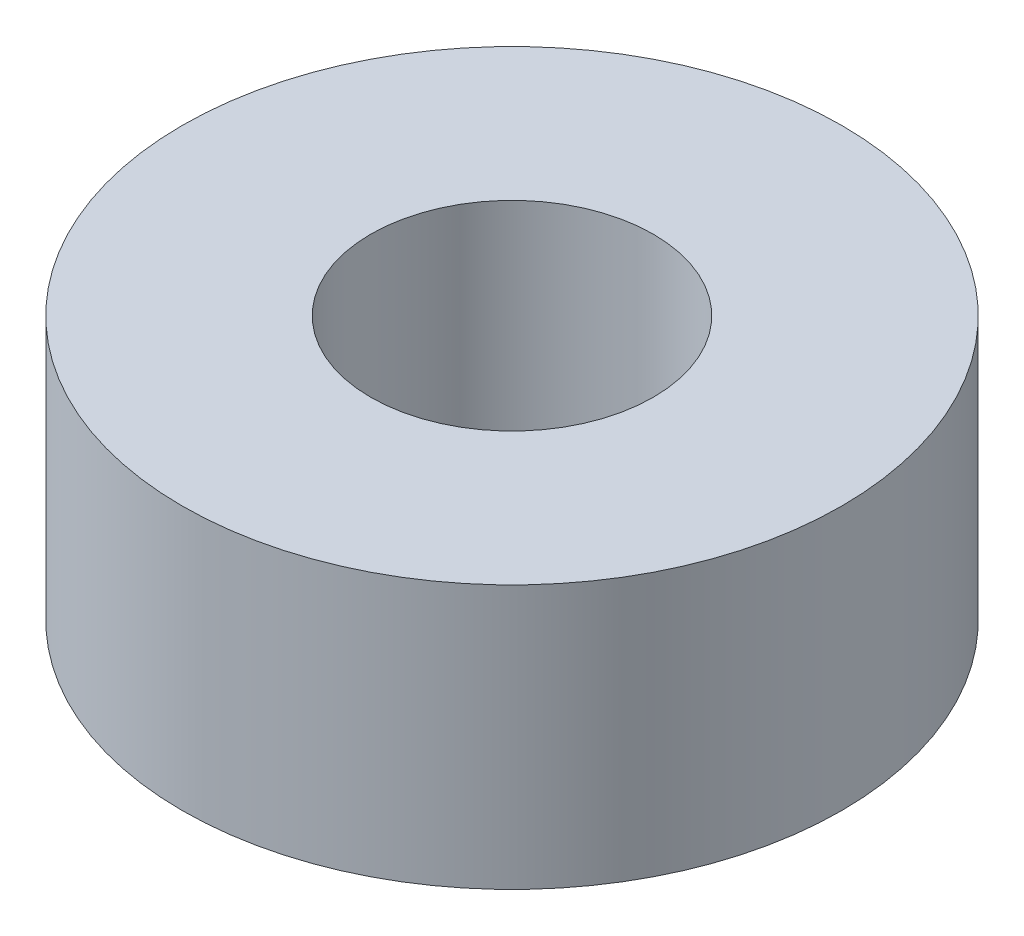
ISO-10303-21;
HEADER;
FILE_DESCRIPTION(('STEP AP214'),'2;1');
FILE_NAME('part.step','',(''),(''),'','','');
FILE_SCHEMA(('AUTOMOTIVE_DESIGN { 1 0 10303 214 1 1 1 1 }'));
ENDSEC;
DATA;
#1=APPLICATION_CONTEXT('core data for automotive mechanical design processes');
#2=APPLICATION_PROTOCOL_DEFINITION('international standard','automotive_design',2000,#1);
#3=PRODUCT_CONTEXT('',#1,'mechanical');
#4=PRODUCT('Part','Part','',(#3));
#5=PRODUCT_RELATED_PRODUCT_CATEGORY('part','',(#4));
#6=PRODUCT_DEFINITION_FORMATION('','',#4);
#7=PRODUCT_DEFINITION_CONTEXT('part definition',#1,'design');
#8=PRODUCT_DEFINITION('design','',#6,#7);
#9=PRODUCT_DEFINITION_SHAPE('','',#8);
#10=(LENGTH_UNIT() NAMED_UNIT(*) SI_UNIT(.MILLI.,.METRE.));
#11=(NAMED_UNIT(*) PLANE_ANGLE_UNIT() SI_UNIT($,.RADIAN.));
#12=(NAMED_UNIT(*) SI_UNIT($,.STERADIAN.) SOLID_ANGLE_UNIT());
#13=UNCERTAINTY_MEASURE_WITH_UNIT(LENGTH_MEASURE(1.E-05),#10,'distance_accuracy_value','');
#14=(GEOMETRIC_REPRESENTATION_CONTEXT(3) GLOBAL_UNCERTAINTY_ASSIGNED_CONTEXT((#13)) GLOBAL_UNIT_ASSIGNED_CONTEXT((#10,
#11,#12)) REPRESENTATION_CONTEXT('',''));
#15=CARTESIAN_POINT('',(0.,0.,0.));
#16=DIRECTION('',(0.,0.,1.));
#17=DIRECTION('',(1.,0.,0.));
#18=AXIS2_PLACEMENT_3D('',#15,#16,#17);
#19=CARTESIAN_POINT('',(0.,14.,0.));
#20=DIRECTION('',(0.,-1.,0.));
#21=DIRECTION('',(0.,0.,-1.));
#22=AXIS2_PLACEMENT_3D('',#19,#20,#21);
#23=CYLINDRICAL_SURFACE('',#22,17.5);
#24=CARTESIAN_POINT('',(0.,14.,0.));
#25=DIRECTION('',(0.,1.,0.));
#26=DIRECTION('',(0.,0.,1.));
#27=AXIS2_PLACEMENT_3D('',#24,#25,#26);
#28=CIRCLE('',#27,17.5);
#29=CARTESIAN_POINT('',(0.,14.,17.5));
#30=VERTEX_POINT('',#29);
#31=EDGE_CURVE('E10',#30,#30,#28,.T.);
#32=ORIENTED_EDGE('',*,*,#31,.F.);
#33=EDGE_LOOP('',(#32));
#34=FACE_BOUND('',#33,.T.);
#35=CARTESIAN_POINT('',(0.,0.,0.));
#36=DIRECTION('',(0.,1.,0.));
#37=DIRECTION('',(0.,0.,1.));
#38=AXIS2_PLACEMENT_3D('',#35,#36,#37);
#39=CIRCLE('',#38,17.5);
#40=CARTESIAN_POINT('',(0.,0.,17.5));
#41=VERTEX_POINT('',#40);
#42=EDGE_CURVE('E37',#41,#41,#39,.T.);
#43=ORIENTED_EDGE('',*,*,#42,.T.);
#44=EDGE_LOOP('',(#43));
#45=FACE_BOUND('',#44,.T.);
#46=ADVANCED_FACE('F40',(#34,#45),#23,.T.);
#47=CARTESIAN_POINT('',(0.,14.,0.));
#48=DIRECTION('',(0.,1.,0.));
#49=DIRECTION('',(0.,0.,1.));
#50=AXIS2_PLACEMENT_3D('',#47,#48,#49);
#51=PLANE('',#50);
#52=CARTESIAN_POINT('',(0.,14.,0.));
#53=DIRECTION('',(0.,1.,0.));
#54=DIRECTION('',(0.,0.,1.));
#55=AXIS2_PLACEMENT_3D('',#52,#53,#54);
#56=CIRCLE('',#55,7.5);
#57=CARTESIAN_POINT('',(0.,14.,7.5));
#58=VERTEX_POINT('',#57);
#59=EDGE_CURVE('E50',#58,#58,#56,.T.);
#60=ORIENTED_EDGE('',*,*,#59,.F.);
#61=EDGE_LOOP('',(#60));
#62=FACE_BOUND('',#61,.T.);
#63=ORIENTED_EDGE('',*,*,#31,.T.);
#64=EDGE_LOOP('',(#63));
#65=FACE_BOUND('',#64,.T.);
#66=ADVANCED_FACE('F59',(#62,#65),#51,.T.);
#67=CARTESIAN_POINT('',(0.,0.,0.));
#68=DIRECTION('',(0.,1.,0.));
#69=DIRECTION('',(0.,0.,1.));
#70=AXIS2_PLACEMENT_3D('',#67,#68,#69);
#71=PLANE('',#70);
#72=CARTESIAN_POINT('',(0.,0.,0.));
#73=DIRECTION('',(0.,1.,0.));
#74=DIRECTION('',(0.,0.,1.));
#75=AXIS2_PLACEMENT_3D('',#72,#73,#74);
#76=CIRCLE('',#75,7.5);
#77=CARTESIAN_POINT('',(0.,0.,7.5));
#78=VERTEX_POINT('',#77);
#79=EDGE_CURVE('E47',#78,#78,#76,.T.);
#80=ORIENTED_EDGE('',*,*,#79,.T.);
#81=EDGE_LOOP('',(#80));
#82=FACE_BOUND('',#81,.T.);
#83=ORIENTED_EDGE('',*,*,#42,.F.);
#84=EDGE_LOOP('',(#83));
#85=FACE_BOUND('',#84,.T.);
#86=ADVANCED_FACE('F58',(#82,#85),#71,.F.);
#87=CARTESIAN_POINT('',(0.,14.,0.));
#88=DIRECTION('',(0.,-1.,0.));
#89=DIRECTION('',(0.,0.,-1.));
#90=AXIS2_PLACEMENT_3D('',#87,#88,#89);
#91=CYLINDRICAL_SURFACE('',#90,7.5);
#92=ORIENTED_EDGE('',*,*,#59,.T.);
#93=EDGE_LOOP('',(#92));
#94=FACE_BOUND('',#93,.T.);
#95=ORIENTED_EDGE('',*,*,#79,.F.);
#96=EDGE_LOOP('',(#95));
#97=FACE_BOUND('',#96,.T.);
#98=ADVANCED_FACE('F54',(#94,#97),#91,.F.);
#99=CLOSED_SHELL('',(#46,#66,#86,#98));
#100=MANIFOLD_SOLID_BREP('B2',#99);
#101=ADVANCED_BREP_SHAPE_REPRESENTATION('',(#18,#100),#14);
#102=SHAPE_DEFINITION_REPRESENTATION(#9,#101);
ENDSEC;
END-ISO-10303-21;
